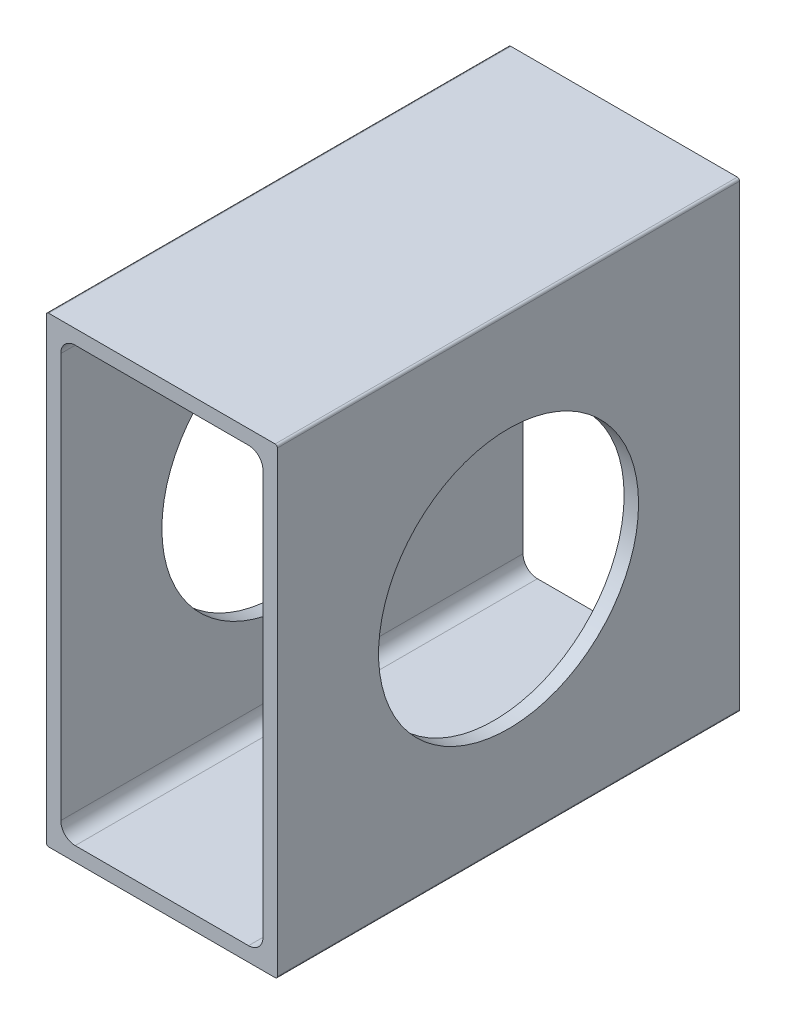
ISO-10303-21;
HEADER;
FILE_DESCRIPTION(('STEP AP214'),'2;1');
FILE_NAME('part.step','',(''),(''),'','','');
FILE_SCHEMA(('AUTOMOTIVE_DESIGN { 1 0 10303 214 1 1 1 1 }'));
ENDSEC;
DATA;
#1=APPLICATION_CONTEXT('core data for automotive mechanical design processes');
#2=APPLICATION_PROTOCOL_DEFINITION('international standard','automotive_design',2000,#1);
#3=PRODUCT_CONTEXT('',#1,'mechanical');
#4=PRODUCT('Part','Part','',(#3));
#5=PRODUCT_RELATED_PRODUCT_CATEGORY('part','',(#4));
#6=PRODUCT_DEFINITION_FORMATION('','',#4);
#7=PRODUCT_DEFINITION_CONTEXT('part definition',#1,'design');
#8=PRODUCT_DEFINITION('design','',#6,#7);
#9=PRODUCT_DEFINITION_SHAPE('','',#8);
#10=(LENGTH_UNIT() NAMED_UNIT(*) SI_UNIT(.MILLI.,.METRE.));
#11=(NAMED_UNIT(*) PLANE_ANGLE_UNIT() SI_UNIT($,.RADIAN.));
#12=(NAMED_UNIT(*) SI_UNIT($,.STERADIAN.) SOLID_ANGLE_UNIT());
#13=UNCERTAINTY_MEASURE_WITH_UNIT(LENGTH_MEASURE(1.E-05),#10,'distance_accuracy_value','');
#14=(GEOMETRIC_REPRESENTATION_CONTEXT(3) GLOBAL_UNCERTAINTY_ASSIGNED_CONTEXT((#13)) GLOBAL_UNIT_ASSIGNED_CONTEXT((#10,
#11,#12)) REPRESENTATION_CONTEXT('',''));
#15=CARTESIAN_POINT('',(0.,0.,0.));
#16=DIRECTION('',(0.,0.,1.));
#17=DIRECTION('',(1.,0.,0.));
#18=AXIS2_PLACEMENT_3D('',#15,#16,#17);
#19=CARTESIAN_POINT('',(12.446,25.146,50.8));
#20=DIRECTION('',(0.,0.,-1.));
#21=DIRECTION('',(-1.,0.,0.));
#22=AXIS2_PLACEMENT_3D('',#19,#20,#21);
#23=CYLINDRICAL_SURFACE('',#22,0.253999999999998);
#24=CARTESIAN_POINT('',(12.446,25.146,0.));
#25=DIRECTION('',(0.,0.,-1.));
#26=DIRECTION('',(-1.,0.,0.));
#27=AXIS2_PLACEMENT_3D('',#24,#25,#26);
#28=CIRCLE('',#27,0.253999999999998);
#29=CARTESIAN_POINT('',(12.446,25.4,0.));
#30=VERTEX_POINT('',#29);
#31=CARTESIAN_POINT('',(12.7,25.146,0.));
#32=VERTEX_POINT('',#31);
#33=EDGE_CURVE('E208',#30,#32,#28,.T.);
#34=ORIENTED_EDGE('',*,*,#33,.F.);
#35=DIRECTION('',(0.,0.,-1.));
#36=VECTOR('',#35,1.);
#37=CARTESIAN_POINT('',(12.446,25.4,50.8));
#38=LINE('',#37,#36);
#39=CARTESIAN_POINT('',(12.446,25.4,50.8));
#40=VERTEX_POINT('',#39);
#41=EDGE_CURVE('E11',#40,#30,#38,.T.);
#42=ORIENTED_EDGE('',*,*,#41,.F.);
#43=CARTESIAN_POINT('',(12.446,25.146,50.8));
#44=DIRECTION('',(0.,0.,-1.));
#45=DIRECTION('',(-1.,0.,0.));
#46=AXIS2_PLACEMENT_3D('',#43,#44,#45);
#47=CIRCLE('',#46,0.253999999999998);
#48=CARTESIAN_POINT('',(12.7,25.146,50.8));
#49=VERTEX_POINT('',#48);
#50=EDGE_CURVE('E220',#40,#49,#47,.T.);
#51=ORIENTED_EDGE('',*,*,#50,.T.);
#52=DIRECTION('',(0.,0.,-1.));
#53=VECTOR('',#52,1.);
#54=CARTESIAN_POINT('',(12.7,25.146,50.8));
#55=LINE('',#54,#53);
#56=EDGE_CURVE('E245',#49,#32,#55,.T.);
#57=ORIENTED_EDGE('',*,*,#56,.T.);
#58=EDGE_LOOP('',(#34,#42,#51,#57));
#59=FACE_BOUND('',#58,.T.);
#60=ADVANCED_FACE('F35',(#59),#23,.T.);
#61=CARTESIAN_POINT('',(-12.446,25.4,50.8));
#62=DIRECTION('',(0.,1.,0.));
#63=DIRECTION('',(0.,0.,1.));
#64=AXIS2_PLACEMENT_3D('',#61,#62,#63);
#65=PLANE('',#64);
#66=DIRECTION('',(1.,0.,0.));
#67=VECTOR('',#66,1.);
#68=CARTESIAN_POINT('',(-12.446,25.4,0.));
#69=LINE('',#68,#67);
#70=CARTESIAN_POINT('',(-12.446,25.4,0.));
#71=VERTEX_POINT('',#70);
#72=EDGE_CURVE('E224',#71,#30,#69,.T.);
#73=ORIENTED_EDGE('',*,*,#72,.F.);
#74=DIRECTION('',(0.,0.,-1.));
#75=VECTOR('',#74,1.);
#76=CARTESIAN_POINT('',(-12.446,25.4,50.8));
#77=LINE('',#76,#75);
#78=CARTESIAN_POINT('',(-12.446,25.4,50.8));
#79=VERTEX_POINT('',#78);
#80=EDGE_CURVE('E43',#79,#71,#77,.T.);
#81=ORIENTED_EDGE('',*,*,#80,.F.);
#82=DIRECTION('',(1.,0.,0.));
#83=VECTOR('',#82,1.);
#84=CARTESIAN_POINT('',(-12.446,25.4,50.8));
#85=LINE('',#84,#83);
#86=EDGE_CURVE('E242',#79,#40,#85,.T.);
#87=ORIENTED_EDGE('',*,*,#86,.T.);
#88=ORIENTED_EDGE('',*,*,#41,.T.);
#89=EDGE_LOOP('',(#73,#81,#87,#88));
#90=FACE_BOUND('',#89,.T.);
#91=ADVANCED_FACE('F291',(#90),#65,.T.);
#92=CARTESIAN_POINT('',(-12.446,25.146,50.8));
#93=DIRECTION('',(0.,0.,-1.));
#94=DIRECTION('',(-1.,0.,0.));
#95=AXIS2_PLACEMENT_3D('',#92,#93,#94);
#96=CYLINDRICAL_SURFACE('',#95,0.253999999999998);
#97=CARTESIAN_POINT('',(-12.446,25.146,0.));
#98=DIRECTION('',(0.,0.,-1.));
#99=DIRECTION('',(-1.,0.,0.));
#100=AXIS2_PLACEMENT_3D('',#97,#98,#99);
#101=CIRCLE('',#100,0.253999999999998);
#102=CARTESIAN_POINT('',(-12.7,25.146,0.));
#103=VERTEX_POINT('',#102);
#104=EDGE_CURVE('E263',#103,#71,#101,.T.);
#105=ORIENTED_EDGE('',*,*,#104,.F.);
#106=DIRECTION('',(0.,0.,-1.));
#107=VECTOR('',#106,1.);
#108=CARTESIAN_POINT('',(-12.7,25.146,50.8));
#109=LINE('',#108,#107);
#110=CARTESIAN_POINT('',(-12.7,25.146,50.8));
#111=VERTEX_POINT('',#110);
#112=EDGE_CURVE('E269',#111,#103,#109,.T.);
#113=ORIENTED_EDGE('',*,*,#112,.F.);
#114=CARTESIAN_POINT('',(-12.446,25.146,50.8));
#115=DIRECTION('',(0.,0.,-1.));
#116=DIRECTION('',(-1.,0.,0.));
#117=AXIS2_PLACEMENT_3D('',#114,#115,#116);
#118=CIRCLE('',#117,0.253999999999998);
#119=EDGE_CURVE('E239',#111,#79,#118,.T.);
#120=ORIENTED_EDGE('',*,*,#119,.T.);
#121=ORIENTED_EDGE('',*,*,#80,.T.);
#122=EDGE_LOOP('',(#105,#113,#120,#121));
#123=FACE_BOUND('',#122,.T.);
#124=ADVANCED_FACE('F310',(#123),#96,.T.);
#125=CARTESIAN_POINT('',(-12.7,-25.146,50.8));
#126=DIRECTION('',(-1.,0.,0.));
#127=DIRECTION('',(0.,0.,1.));
#128=AXIS2_PLACEMENT_3D('',#125,#126,#127);
#129=PLANE('',#128);
#130=CARTESIAN_POINT('',(-12.7,0.,25.4));
#131=DIRECTION('',(-1.,0.,0.));
#132=DIRECTION('',(0.,0.,1.));
#133=AXIS2_PLACEMENT_3D('',#130,#131,#132);
#134=CIRCLE('',#133,14.2875);
#135=CARTESIAN_POINT('',(-12.7,0.,39.6875));
#136=VERTEX_POINT('',#135);
#137=EDGE_CURVE('E491',#136,#136,#134,.T.);
#138=ORIENTED_EDGE('',*,*,#137,.F.);
#139=EDGE_LOOP('',(#138));
#140=FACE_BOUND('',#139,.T.);
#141=DIRECTION('',(0.,1.,0.));
#142=VECTOR('',#141,1.);
#143=CARTESIAN_POINT('',(-12.7,-25.146,0.));
#144=LINE('',#143,#142);
#145=CARTESIAN_POINT('',(-12.7,-25.146,0.));
#146=VERTEX_POINT('',#145);
#147=EDGE_CURVE('E260',#146,#103,#144,.T.);
#148=ORIENTED_EDGE('',*,*,#147,.F.);
#149=DIRECTION('',(0.,0.,-1.));
#150=VECTOR('',#149,1.);
#151=CARTESIAN_POINT('',(-12.7,-25.146,50.8));
#152=LINE('',#151,#150);
#153=CARTESIAN_POINT('',(-12.7,-25.146,50.8));
#154=VERTEX_POINT('',#153);
#155=EDGE_CURVE('E271',#154,#146,#152,.T.);
#156=ORIENTED_EDGE('',*,*,#155,.F.);
#157=DIRECTION('',(0.,1.,0.));
#158=VECTOR('',#157,1.);
#159=CARTESIAN_POINT('',(-12.7,-25.146,50.8));
#160=LINE('',#159,#158);
#161=EDGE_CURVE('E236',#154,#111,#160,.T.);
#162=ORIENTED_EDGE('',*,*,#161,.T.);
#163=ORIENTED_EDGE('',*,*,#112,.T.);
#164=EDGE_LOOP('',(#148,#156,#162,#163));
#165=FACE_BOUND('',#164,.T.);
#166=ADVANCED_FACE('F308',(#140,#165),#129,.T.);
#167=CARTESIAN_POINT('',(-12.446,-25.146,50.8));
#168=DIRECTION('',(0.,0.,-1.));
#169=DIRECTION('',(-1.,0.,0.));
#170=AXIS2_PLACEMENT_3D('',#167,#168,#169);
#171=CYLINDRICAL_SURFACE('',#170,0.253999999999998);
#172=CARTESIAN_POINT('',(-12.446,-25.146,0.));
#173=DIRECTION('',(0.,0.,-1.));
#174=DIRECTION('',(-1.,0.,0.));
#175=AXIS2_PLACEMENT_3D('',#172,#173,#174);
#176=CIRCLE('',#175,0.253999999999998);
#177=CARTESIAN_POINT('',(-12.446,-25.4,0.));
#178=VERTEX_POINT('',#177);
#179=EDGE_CURVE('E257',#178,#146,#176,.T.);
#180=ORIENTED_EDGE('',*,*,#179,.F.);
#181=DIRECTION('',(0.,0.,-1.));
#182=VECTOR('',#181,1.);
#183=CARTESIAN_POINT('',(-12.446,-25.4,50.8));
#184=LINE('',#183,#182);
#185=CARTESIAN_POINT('',(-12.446,-25.4,50.8));
#186=VERTEX_POINT('',#185);
#187=EDGE_CURVE('E273',#186,#178,#184,.T.);
#188=ORIENTED_EDGE('',*,*,#187,.F.);
#189=CARTESIAN_POINT('',(-12.446,-25.146,50.8));
#190=DIRECTION('',(0.,0.,-1.));
#191=DIRECTION('',(-1.,0.,0.));
#192=AXIS2_PLACEMENT_3D('',#189,#190,#191);
#193=CIRCLE('',#192,0.253999999999998);
#194=EDGE_CURVE('E233',#186,#154,#193,.T.);
#195=ORIENTED_EDGE('',*,*,#194,.T.);
#196=ORIENTED_EDGE('',*,*,#155,.T.);
#197=EDGE_LOOP('',(#180,#188,#195,#196));
#198=FACE_BOUND('',#197,.T.);
#199=ADVANCED_FACE('F304',(#198),#171,.T.);
#200=CARTESIAN_POINT('',(12.446,-25.4,50.8));
#201=DIRECTION('',(0.,-1.,0.));
#202=DIRECTION('',(0.,0.,-1.));
#203=AXIS2_PLACEMENT_3D('',#200,#201,#202);
#204=PLANE('',#203);
#205=DIRECTION('',(-1.,0.,0.));
#206=VECTOR('',#205,1.);
#207=CARTESIAN_POINT('',(12.446,-25.4,0.));
#208=LINE('',#207,#206);
#209=CARTESIAN_POINT('',(12.446,-25.4,0.));
#210=VERTEX_POINT('',#209);
#211=EDGE_CURVE('E254',#210,#178,#208,.T.);
#212=ORIENTED_EDGE('',*,*,#211,.F.);
#213=DIRECTION('',(0.,0.,-1.));
#214=VECTOR('',#213,1.);
#215=CARTESIAN_POINT('',(12.446,-25.4,50.8));
#216=LINE('',#215,#214);
#217=CARTESIAN_POINT('',(12.446,-25.4,50.8));
#218=VERTEX_POINT('',#217);
#219=EDGE_CURVE('E275',#218,#210,#216,.T.);
#220=ORIENTED_EDGE('',*,*,#219,.F.);
#221=DIRECTION('',(-1.,0.,0.));
#222=VECTOR('',#221,1.);
#223=CARTESIAN_POINT('',(12.446,-25.4,50.8));
#224=LINE('',#223,#222);
#225=EDGE_CURVE('E230',#218,#186,#224,.T.);
#226=ORIENTED_EDGE('',*,*,#225,.T.);
#227=ORIENTED_EDGE('',*,*,#187,.T.);
#228=EDGE_LOOP('',(#212,#220,#226,#227));
#229=FACE_BOUND('',#228,.T.);
#230=ADVANCED_FACE('F302',(#229),#204,.T.);
#231=CARTESIAN_POINT('',(12.446,-25.146,50.8));
#232=DIRECTION('',(0.,0.,-1.));
#233=DIRECTION('',(-1.,0.,0.));
#234=AXIS2_PLACEMENT_3D('',#231,#232,#233);
#235=CYLINDRICAL_SURFACE('',#234,0.253999999999998);
#236=CARTESIAN_POINT('',(12.446,-25.146,0.));
#237=DIRECTION('',(0.,0.,-1.));
#238=DIRECTION('',(-1.,0.,0.));
#239=AXIS2_PLACEMENT_3D('',#236,#237,#238);
#240=CIRCLE('',#239,0.253999999999998);
#241=CARTESIAN_POINT('',(12.7,-25.146,0.));
#242=VERTEX_POINT('',#241);
#243=EDGE_CURVE('E251',#242,#210,#240,.T.);
#244=ORIENTED_EDGE('',*,*,#243,.F.);
#245=DIRECTION('',(0.,0.,-1.));
#246=VECTOR('',#245,1.);
#247=CARTESIAN_POINT('',(12.7,-25.146,50.8));
#248=LINE('',#247,#246);
#249=CARTESIAN_POINT('',(12.7,-25.146,50.8));
#250=VERTEX_POINT('',#249);
#251=EDGE_CURVE('E277',#250,#242,#248,.T.);
#252=ORIENTED_EDGE('',*,*,#251,.F.);
#253=CARTESIAN_POINT('',(12.446,-25.146,50.8));
#254=DIRECTION('',(0.,0.,-1.));
#255=DIRECTION('',(-1.,0.,0.));
#256=AXIS2_PLACEMENT_3D('',#253,#254,#255);
#257=CIRCLE('',#256,0.253999999999998);
#258=EDGE_CURVE('E227',#250,#218,#257,.T.);
#259=ORIENTED_EDGE('',*,*,#258,.T.);
#260=ORIENTED_EDGE('',*,*,#219,.T.);
#261=EDGE_LOOP('',(#244,#252,#259,#260));
#262=FACE_BOUND('',#261,.T.);
#263=ADVANCED_FACE('F298',(#262),#235,.T.);
#264=CARTESIAN_POINT('',(12.7,25.146,50.8));
#265=DIRECTION('',(1.,0.,0.));
#266=DIRECTION('',(0.,0.,-1.));
#267=AXIS2_PLACEMENT_3D('',#264,#265,#266);
#268=PLANE('',#267);
#269=CARTESIAN_POINT('',(12.7,0.,25.4));
#270=DIRECTION('',(1.,0.,0.));
#271=DIRECTION('',(0.,0.,-1.));
#272=AXIS2_PLACEMENT_3D('',#269,#270,#271);
#273=CIRCLE('',#272,14.2875);
#274=CARTESIAN_POINT('',(12.7,0.,11.1125));
#275=VERTEX_POINT('',#274);
#276=EDGE_CURVE('E173',#275,#275,#273,.T.);
#277=ORIENTED_EDGE('',*,*,#276,.F.);
#278=EDGE_LOOP('',(#277));
#279=FACE_BOUND('',#278,.T.);
#280=DIRECTION('',(0.,-1.,0.));
#281=VECTOR('',#280,1.);
#282=CARTESIAN_POINT('',(12.7,25.146,0.));
#283=LINE('',#282,#281);
#284=EDGE_CURVE('E248',#32,#242,#283,.T.);
#285=ORIENTED_EDGE('',*,*,#284,.F.);
#286=ORIENTED_EDGE('',*,*,#56,.F.);
#287=DIRECTION('',(0.,-1.,0.));
#288=VECTOR('',#287,1.);
#289=CARTESIAN_POINT('',(12.7,25.146,50.8));
#290=LINE('',#289,#288);
#291=EDGE_CURVE('E223',#49,#250,#290,.T.);
#292=ORIENTED_EDGE('',*,*,#291,.T.);
#293=ORIENTED_EDGE('',*,*,#251,.T.);
#294=EDGE_LOOP('',(#285,#286,#292,#293));
#295=FACE_BOUND('',#294,.T.);
#296=ADVANCED_FACE('F284',(#279,#295),#268,.T.);
#297=CARTESIAN_POINT('',(12.446,25.146,50.8));
#298=DIRECTION('',(0.,0.,-1.));
#299=DIRECTION('',(-1.,0.,0.));
#300=AXIS2_PLACEMENT_3D('',#297,#298,#299);
#301=PLANE('',#300);
#302=DIRECTION('',(0.,-1.,0.));
#303=VECTOR('',#302,1.);
#304=CARTESIAN_POINT('',(11.1125,-22.225,50.8));
#305=LINE('',#304,#303);
#306=CARTESIAN_POINT('',(11.1125,22.225,50.8));
#307=VERTEX_POINT('',#306);
#308=CARTESIAN_POINT('',(11.1125,-22.225,50.8));
#309=VERTEX_POINT('',#308);
#310=EDGE_CURVE('E156',#307,#309,#305,.T.);
#311=ORIENTED_EDGE('',*,*,#310,.T.);
#312=CARTESIAN_POINT('',(9.525,-22.225,50.8));
#313=DIRECTION('',(0.,0.,-1.));
#314=DIRECTION('',(1.,0.,0.));
#315=AXIS2_PLACEMENT_3D('',#312,#313,#314);
#316=CIRCLE('',#315,1.5875);
#317=CARTESIAN_POINT('',(9.525,-23.8125,50.8));
#318=VERTEX_POINT('',#317);
#319=EDGE_CURVE('E150',#309,#318,#316,.T.);
#320=ORIENTED_EDGE('',*,*,#319,.T.);
#321=DIRECTION('',(-1.,0.,0.));
#322=VECTOR('',#321,1.);
#323=CARTESIAN_POINT('',(-9.525,-23.8125,50.8));
#324=LINE('',#323,#322);
#325=CARTESIAN_POINT('',(-9.525,-23.8125,50.8));
#326=VERTEX_POINT('',#325);
#327=EDGE_CURVE('E159',#318,#326,#324,.T.);
#328=ORIENTED_EDGE('',*,*,#327,.T.);
#329=CARTESIAN_POINT('',(-9.525,-22.225,50.8));
#330=DIRECTION('',(0.,0.,-1.));
#331=DIRECTION('',(1.,0.,0.));
#332=AXIS2_PLACEMENT_3D('',#329,#330,#331);
#333=CIRCLE('',#332,1.5875);
#334=CARTESIAN_POINT('',(-11.1125,-22.225,50.8));
#335=VERTEX_POINT('',#334);
#336=EDGE_CURVE('E51',#326,#335,#333,.T.);
#337=ORIENTED_EDGE('',*,*,#336,.T.);
#338=DIRECTION('',(0.,1.,0.));
#339=VECTOR('',#338,1.);
#340=CARTESIAN_POINT('',(-11.1125,22.225,50.8));
#341=LINE('',#340,#339);
#342=CARTESIAN_POINT('',(-11.1125,22.225,50.8));
#343=VERTEX_POINT('',#342);
#344=EDGE_CURVE('E177',#335,#343,#341,.T.);
#345=ORIENTED_EDGE('',*,*,#344,.T.);
#346=CARTESIAN_POINT('',(-9.525,22.225,50.8));
#347=DIRECTION('',(0.,0.,-1.));
#348=DIRECTION('',(1.,0.,0.));
#349=AXIS2_PLACEMENT_3D('',#346,#347,#348);
#350=CIRCLE('',#349,1.5875);
#351=CARTESIAN_POINT('',(-9.525,23.8125,50.8));
#352=VERTEX_POINT('',#351);
#353=EDGE_CURVE('E180',#343,#352,#350,.T.);
#354=ORIENTED_EDGE('',*,*,#353,.T.);
#355=DIRECTION('',(1.,0.,0.));
#356=VECTOR('',#355,1.);
#357=CARTESIAN_POINT('',(9.525,23.8125,50.8));
#358=LINE('',#357,#356);
#359=CARTESIAN_POINT('',(9.525,23.8125,50.8));
#360=VERTEX_POINT('',#359);
#361=EDGE_CURVE('E183',#352,#360,#358,.T.);
#362=ORIENTED_EDGE('',*,*,#361,.T.);
#363=CARTESIAN_POINT('',(9.525,22.225,50.8));
#364=DIRECTION('',(0.,0.,-1.));
#365=DIRECTION('',(1.,0.,0.));
#366=AXIS2_PLACEMENT_3D('',#363,#364,#365);
#367=CIRCLE('',#366,1.5875);
#368=EDGE_CURVE('E186',#360,#307,#367,.T.);
#369=ORIENTED_EDGE('',*,*,#368,.T.);
#370=EDGE_LOOP('',(#311,#320,#328,#337,#345,#354,#362,#369));
#371=FACE_BOUND('',#370,.T.);
#372=ORIENTED_EDGE('',*,*,#50,.F.);
#373=ORIENTED_EDGE('',*,*,#86,.F.);
#374=ORIENTED_EDGE('',*,*,#119,.F.);
#375=ORIENTED_EDGE('',*,*,#161,.F.);
#376=ORIENTED_EDGE('',*,*,#194,.F.);
#377=ORIENTED_EDGE('',*,*,#225,.F.);
#378=ORIENTED_EDGE('',*,*,#258,.F.);
#379=ORIENTED_EDGE('',*,*,#291,.F.);
#380=EDGE_LOOP('',(#372,#373,#374,#375,#376,#377,#378,#379));
#381=FACE_BOUND('',#380,.T.);
#382=ADVANCED_FACE('F163',(#371,#381),#301,.F.);
#383=CARTESIAN_POINT('',(12.446,25.146,0.));
#384=DIRECTION('',(0.,0.,-1.));
#385=DIRECTION('',(-1.,0.,0.));
#386=AXIS2_PLACEMENT_3D('',#383,#384,#385);
#387=PLANE('',#386);
#388=CARTESIAN_POINT('',(9.525,-22.225,0.));
#389=DIRECTION('',(0.,0.,-1.));
#390=DIRECTION('',(1.,0.,0.));
#391=AXIS2_PLACEMENT_3D('',#388,#389,#390);
#392=CIRCLE('',#391,1.5875);
#393=CARTESIAN_POINT('',(11.1125,-22.225,0.));
#394=VERTEX_POINT('',#393);
#395=CARTESIAN_POINT('',(9.525,-23.8125,0.));
#396=VERTEX_POINT('',#395);
#397=EDGE_CURVE('E59',#394,#396,#392,.T.);
#398=ORIENTED_EDGE('',*,*,#397,.F.);
#399=DIRECTION('',(0.,-1.,0.));
#400=VECTOR('',#399,1.);
#401=CARTESIAN_POINT('',(11.1125,-22.225,0.));
#402=LINE('',#401,#400);
#403=CARTESIAN_POINT('',(11.1125,22.225,0.));
#404=VERTEX_POINT('',#403);
#405=EDGE_CURVE('E167',#404,#394,#402,.T.);
#406=ORIENTED_EDGE('',*,*,#405,.F.);
#407=CARTESIAN_POINT('',(9.525,22.225,0.));
#408=DIRECTION('',(0.,0.,-1.));
#409=DIRECTION('',(1.,0.,0.));
#410=AXIS2_PLACEMENT_3D('',#407,#408,#409);
#411=CIRCLE('',#410,1.5875);
#412=CARTESIAN_POINT('',(9.525,23.8125,0.));
#413=VERTEX_POINT('',#412);
#414=EDGE_CURVE('E170',#413,#404,#411,.T.);
#415=ORIENTED_EDGE('',*,*,#414,.F.);
#416=DIRECTION('',(1.,0.,0.));
#417=VECTOR('',#416,1.);
#418=CARTESIAN_POINT('',(9.525,23.8125,0.));
#419=LINE('',#418,#417);
#420=CARTESIAN_POINT('',(-9.525,23.8125,0.));
#421=VERTEX_POINT('',#420);
#422=EDGE_CURVE('E201',#421,#413,#419,.T.);
#423=ORIENTED_EDGE('',*,*,#422,.F.);
#424=CARTESIAN_POINT('',(-9.525,22.225,0.));
#425=DIRECTION('',(0.,0.,-1.));
#426=DIRECTION('',(1.,0.,0.));
#427=AXIS2_PLACEMENT_3D('',#424,#425,#426);
#428=CIRCLE('',#427,1.5875);
#429=CARTESIAN_POINT('',(-11.1125,22.225,0.));
#430=VERTEX_POINT('',#429);
#431=EDGE_CURVE('E198',#430,#421,#428,.T.);
#432=ORIENTED_EDGE('',*,*,#431,.F.);
#433=DIRECTION('',(0.,1.,0.));
#434=VECTOR('',#433,1.);
#435=CARTESIAN_POINT('',(-11.1125,22.225,0.));
#436=LINE('',#435,#434);
#437=CARTESIAN_POINT('',(-11.1125,-22.225,0.));
#438=VERTEX_POINT('',#437);
#439=EDGE_CURVE('E195',#438,#430,#436,.T.);
#440=ORIENTED_EDGE('',*,*,#439,.F.);
#441=CARTESIAN_POINT('',(-9.525,-22.225,0.));
#442=DIRECTION('',(0.,0.,-1.));
#443=DIRECTION('',(1.,0.,0.));
#444=AXIS2_PLACEMENT_3D('',#441,#442,#443);
#445=CIRCLE('',#444,1.5875);
#446=CARTESIAN_POINT('',(-9.525,-23.8125,0.));
#447=VERTEX_POINT('',#446);
#448=EDGE_CURVE('E192',#447,#438,#445,.T.);
#449=ORIENTED_EDGE('',*,*,#448,.F.);
#450=DIRECTION('',(-1.,0.,0.));
#451=VECTOR('',#450,1.);
#452=CARTESIAN_POINT('',(-9.525,-23.8125,0.));
#453=LINE('',#452,#451);
#454=EDGE_CURVE('E190',#396,#447,#453,.T.);
#455=ORIENTED_EDGE('',*,*,#454,.F.);
#456=EDGE_LOOP('',(#398,#406,#415,#423,#432,#440,#449,#455));
#457=FACE_BOUND('',#456,.T.);
#458=ORIENTED_EDGE('',*,*,#33,.T.);
#459=ORIENTED_EDGE('',*,*,#284,.T.);
#460=ORIENTED_EDGE('',*,*,#243,.T.);
#461=ORIENTED_EDGE('',*,*,#211,.T.);
#462=ORIENTED_EDGE('',*,*,#179,.T.);
#463=ORIENTED_EDGE('',*,*,#147,.T.);
#464=ORIENTED_EDGE('',*,*,#104,.T.);
#465=ORIENTED_EDGE('',*,*,#72,.T.);
#466=EDGE_LOOP('',(#458,#459,#460,#461,#462,#463,#464,#465));
#467=FACE_BOUND('',#466,.T.);
#468=ADVANCED_FACE('F287',(#457,#467),#387,.T.);
#469=CARTESIAN_POINT('',(9.525,-22.225,50.8));
#470=DIRECTION('',(0.,0.,-1.));
#471=DIRECTION('',(-1.,0.,0.));
#472=AXIS2_PLACEMENT_3D('',#469,#470,#471);
#473=CYLINDRICAL_SURFACE('',#472,1.5875);
#474=ORIENTED_EDGE('',*,*,#397,.T.);
#475=DIRECTION('',(0.,0.,-1.));
#476=VECTOR('',#475,1.);
#477=CARTESIAN_POINT('',(9.525,-23.8125,50.8));
#478=LINE('',#477,#476);
#479=EDGE_CURVE('E146',#318,#396,#478,.T.);
#480=ORIENTED_EDGE('',*,*,#479,.F.);
#481=ORIENTED_EDGE('',*,*,#319,.F.);
#482=DIRECTION('',(0.,0.,-1.));
#483=VECTOR('',#482,1.);
#484=CARTESIAN_POINT('',(11.1125,-22.225,50.8));
#485=LINE('',#484,#483);
#486=EDGE_CURVE('E206',#309,#394,#485,.T.);
#487=ORIENTED_EDGE('',*,*,#486,.T.);
#488=EDGE_LOOP('',(#474,#480,#481,#487));
#489=FACE_BOUND('',#488,.T.);
#490=ADVANCED_FACE('F148',(#489),#473,.F.);
#491=CARTESIAN_POINT('',(11.1125,-22.225,50.8));
#492=DIRECTION('',(1.,0.,0.));
#493=DIRECTION('',(0.,0.,-1.));
#494=AXIS2_PLACEMENT_3D('',#491,#492,#493);
#495=PLANE('',#494);
#496=CARTESIAN_POINT('',(11.1125,0.,25.4));
#497=DIRECTION('',(1.,0.,0.));
#498=DIRECTION('',(0.,0.,-1.));
#499=AXIS2_PLACEMENT_3D('',#496,#497,#498);
#500=CIRCLE('',#499,14.2875);
#501=CARTESIAN_POINT('',(11.1125,0.,11.1125));
#502=VERTEX_POINT('',#501);
#503=EDGE_CURVE('E489',#502,#502,#500,.T.);
#504=ORIENTED_EDGE('',*,*,#503,.T.);
#505=EDGE_LOOP('',(#504));
#506=FACE_BOUND('',#505,.T.);
#507=ORIENTED_EDGE('',*,*,#405,.T.);
#508=ORIENTED_EDGE('',*,*,#486,.F.);
#509=ORIENTED_EDGE('',*,*,#310,.F.);
#510=DIRECTION('',(0.,0.,-1.));
#511=VECTOR('',#510,1.);
#512=CARTESIAN_POINT('',(11.1125,22.225,50.8));
#513=LINE('',#512,#511);
#514=EDGE_CURVE('E209',#307,#404,#513,.T.);
#515=ORIENTED_EDGE('',*,*,#514,.T.);
#516=EDGE_LOOP('',(#507,#508,#509,#515));
#517=FACE_BOUND('',#516,.T.);
#518=ADVANCED_FACE('F384',(#506,#517),#495,.F.);
#519=CARTESIAN_POINT('',(9.525,22.225,50.8));
#520=DIRECTION('',(0.,0.,-1.));
#521=DIRECTION('',(-1.,0.,0.));
#522=AXIS2_PLACEMENT_3D('',#519,#520,#521);
#523=CYLINDRICAL_SURFACE('',#522,1.5875);
#524=ORIENTED_EDGE('',*,*,#414,.T.);
#525=ORIENTED_EDGE('',*,*,#514,.F.);
#526=ORIENTED_EDGE('',*,*,#368,.F.);
#527=DIRECTION('',(0.,0.,-1.));
#528=VECTOR('',#527,1.);
#529=CARTESIAN_POINT('',(9.525,23.8125,50.8));
#530=LINE('',#529,#528);
#531=EDGE_CURVE('E211',#360,#413,#530,.T.);
#532=ORIENTED_EDGE('',*,*,#531,.T.);
#533=EDGE_LOOP('',(#524,#525,#526,#532));
#534=FACE_BOUND('',#533,.T.);
#535=ADVANCED_FACE('F391',(#534),#523,.F.);
#536=CARTESIAN_POINT('',(9.525,23.8125,50.8));
#537=DIRECTION('',(0.,1.,0.));
#538=DIRECTION('',(0.,0.,1.));
#539=AXIS2_PLACEMENT_3D('',#536,#537,#538);
#540=PLANE('',#539);
#541=ORIENTED_EDGE('',*,*,#422,.T.);
#542=ORIENTED_EDGE('',*,*,#531,.F.);
#543=ORIENTED_EDGE('',*,*,#361,.F.);
#544=DIRECTION('',(0.,0.,-1.));
#545=VECTOR('',#544,1.);
#546=CARTESIAN_POINT('',(-9.525,23.8125,50.8));
#547=LINE('',#546,#545);
#548=EDGE_CURVE('E213',#352,#421,#547,.T.);
#549=ORIENTED_EDGE('',*,*,#548,.T.);
#550=EDGE_LOOP('',(#541,#542,#543,#549));
#551=FACE_BOUND('',#550,.T.);
#552=ADVANCED_FACE('F396',(#551),#540,.F.);
#553=CARTESIAN_POINT('',(-9.525,22.225,50.8));
#554=DIRECTION('',(0.,0.,-1.));
#555=DIRECTION('',(-1.,0.,0.));
#556=AXIS2_PLACEMENT_3D('',#553,#554,#555);
#557=CYLINDRICAL_SURFACE('',#556,1.5875);
#558=ORIENTED_EDGE('',*,*,#431,.T.);
#559=ORIENTED_EDGE('',*,*,#548,.F.);
#560=ORIENTED_EDGE('',*,*,#353,.F.);
#561=DIRECTION('',(0.,0.,-1.));
#562=VECTOR('',#561,1.);
#563=CARTESIAN_POINT('',(-11.1125,22.225,50.8));
#564=LINE('',#563,#562);
#565=EDGE_CURVE('E215',#343,#430,#564,.T.);
#566=ORIENTED_EDGE('',*,*,#565,.T.);
#567=EDGE_LOOP('',(#558,#559,#560,#566));
#568=FACE_BOUND('',#567,.T.);
#569=ADVANCED_FACE('F406',(#568),#557,.F.);
#570=CARTESIAN_POINT('',(-11.1125,22.225,50.8));
#571=DIRECTION('',(-1.,0.,0.));
#572=DIRECTION('',(0.,0.,1.));
#573=AXIS2_PLACEMENT_3D('',#570,#571,#572);
#574=PLANE('',#573);
#575=CARTESIAN_POINT('',(-11.1125,0.,25.4));
#576=DIRECTION('',(-1.,0.,0.));
#577=DIRECTION('',(0.,0.,1.));
#578=AXIS2_PLACEMENT_3D('',#575,#576,#577);
#579=CIRCLE('',#578,14.2875);
#580=CARTESIAN_POINT('',(-11.1125,0.,39.6875));
#581=VERTEX_POINT('',#580);
#582=EDGE_CURVE('E38',#581,#581,#579,.T.);
#583=ORIENTED_EDGE('',*,*,#582,.T.);
#584=EDGE_LOOP('',(#583));
#585=FACE_BOUND('',#584,.T.);
#586=ORIENTED_EDGE('',*,*,#439,.T.);
#587=ORIENTED_EDGE('',*,*,#565,.F.);
#588=ORIENTED_EDGE('',*,*,#344,.F.);
#589=DIRECTION('',(0.,0.,-1.));
#590=VECTOR('',#589,1.);
#591=CARTESIAN_POINT('',(-11.1125,-22.225,50.8));
#592=LINE('',#591,#590);
#593=EDGE_CURVE('E217',#335,#438,#592,.T.);
#594=ORIENTED_EDGE('',*,*,#593,.T.);
#595=EDGE_LOOP('',(#586,#587,#588,#594));
#596=FACE_BOUND('',#595,.T.);
#597=ADVANCED_FACE('F416',(#585,#596),#574,.F.);
#598=CARTESIAN_POINT('',(-9.525,-22.225,50.8));
#599=DIRECTION('',(0.,0.,-1.));
#600=DIRECTION('',(-1.,0.,0.));
#601=AXIS2_PLACEMENT_3D('',#598,#599,#600);
#602=CYLINDRICAL_SURFACE('',#601,1.5875);
#603=ORIENTED_EDGE('',*,*,#448,.T.);
#604=ORIENTED_EDGE('',*,*,#593,.F.);
#605=ORIENTED_EDGE('',*,*,#336,.F.);
#606=DIRECTION('',(0.,0.,-1.));
#607=VECTOR('',#606,1.);
#608=CARTESIAN_POINT('',(-9.525,-23.8125,50.8));
#609=LINE('',#608,#607);
#610=EDGE_CURVE('E155',#326,#447,#609,.T.);
#611=ORIENTED_EDGE('',*,*,#610,.T.);
#612=EDGE_LOOP('',(#603,#604,#605,#611));
#613=FACE_BOUND('',#612,.T.);
#614=ADVANCED_FACE('F424',(#613),#602,.F.);
#615=CARTESIAN_POINT('',(-9.525,-23.8125,50.8));
#616=DIRECTION('',(0.,-1.,0.));
#617=DIRECTION('',(0.,0.,-1.));
#618=AXIS2_PLACEMENT_3D('',#615,#616,#617);
#619=PLANE('',#618);
#620=ORIENTED_EDGE('',*,*,#454,.T.);
#621=ORIENTED_EDGE('',*,*,#610,.F.);
#622=ORIENTED_EDGE('',*,*,#327,.F.);
#623=ORIENTED_EDGE('',*,*,#479,.T.);
#624=EDGE_LOOP('',(#620,#621,#622,#623));
#625=FACE_BOUND('',#624,.T.);
#626=ADVANCED_FACE('F160',(#625),#619,.F.);
#627=CARTESIAN_POINT('',(38.1,0.,25.4));
#628=DIRECTION('',(-1.,0.,0.));
#629=DIRECTION('',(0.,0.,1.));
#630=AXIS2_PLACEMENT_3D('',#627,#628,#629);
#631=CYLINDRICAL_SURFACE('',#630,14.2875);
#632=ORIENTED_EDGE('',*,*,#137,.T.);
#633=EDGE_LOOP('',(#632));
#634=FACE_BOUND('',#633,.T.);
#635=ORIENTED_EDGE('',*,*,#582,.F.);
#636=EDGE_LOOP('',(#635));
#637=FACE_BOUND('',#636,.T.);
#638=ADVANCED_FACE('F437',(#634,#637),#631,.F.);
#639=ORIENTED_EDGE('',*,*,#276,.T.);
#640=EDGE_LOOP('',(#639));
#641=FACE_BOUND('',#640,.T.);
#642=ORIENTED_EDGE('',*,*,#503,.F.);
#643=EDGE_LOOP('',(#642));
#644=FACE_BOUND('',#643,.T.);
#645=ADVANCED_FACE('F471',(#641,#644),#631,.F.);
#646=CLOSED_SHELL('',(#60,#91,#124,#166,#199,#230,#263,#296,#382,#468,#490,#518,#535,#552,#569,
#597,#614,#626,#638,#645));
#647=MANIFOLD_SOLID_BREP('B2',#646);
#648=ADVANCED_BREP_SHAPE_REPRESENTATION('',(#18,#647),#14);
#649=SHAPE_DEFINITION_REPRESENTATION(#9,#648);
ENDSEC;
END-ISO-10303-21;
